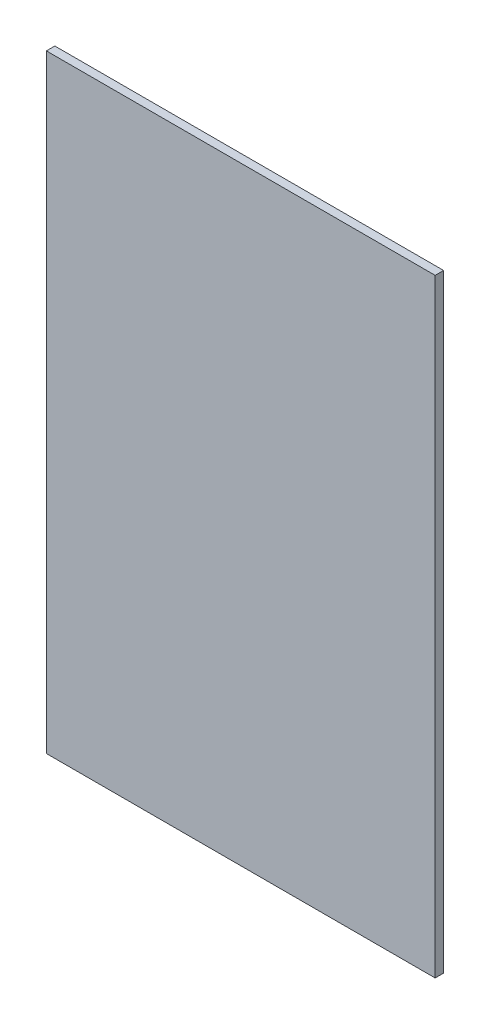
ISO-10303-21;
HEADER;
FILE_DESCRIPTION(('STEP AP214'),'2;1');
FILE_NAME('part.step','',(''),(''),'','','');
FILE_SCHEMA(('AUTOMOTIVE_DESIGN { 1 0 10303 214 1 1 1 1 }'));
ENDSEC;
DATA;
#1=APPLICATION_CONTEXT('core data for automotive mechanical design processes');
#2=APPLICATION_PROTOCOL_DEFINITION('international standard','automotive_design',2000,#1);
#3=PRODUCT_CONTEXT('',#1,'mechanical');
#4=PRODUCT('Part','Part','',(#3));
#5=PRODUCT_RELATED_PRODUCT_CATEGORY('part','',(#4));
#6=PRODUCT_DEFINITION_FORMATION('','',#4);
#7=PRODUCT_DEFINITION_CONTEXT('part definition',#1,'design');
#8=PRODUCT_DEFINITION('design','',#6,#7);
#9=PRODUCT_DEFINITION_SHAPE('','',#8);
#10=(LENGTH_UNIT() NAMED_UNIT(*) SI_UNIT(.MILLI.,.METRE.));
#11=(NAMED_UNIT(*) PLANE_ANGLE_UNIT() SI_UNIT($,.RADIAN.));
#12=(NAMED_UNIT(*) SI_UNIT($,.STERADIAN.) SOLID_ANGLE_UNIT());
#13=UNCERTAINTY_MEASURE_WITH_UNIT(LENGTH_MEASURE(1.E-05),#10,'distance_accuracy_value','');
#14=(GEOMETRIC_REPRESENTATION_CONTEXT(3) GLOBAL_UNCERTAINTY_ASSIGNED_CONTEXT((#13)) GLOBAL_UNIT_ASSIGNED_CONTEXT((#10,
#11,#12)) REPRESENTATION_CONTEXT('',''));
#15=CARTESIAN_POINT('',(0.,0.,0.));
#16=DIRECTION('',(0.,0.,1.));
#17=DIRECTION('',(1.,0.,0.));
#18=AXIS2_PLACEMENT_3D('',#15,#16,#17);
#19=CARTESIAN_POINT('',(292.1,-457.2,12.7));
#20=DIRECTION('',(-1.,0.,0.));
#21=DIRECTION('',(0.,0.,1.));
#22=AXIS2_PLACEMENT_3D('',#19,#20,#21);
#23=PLANE('',#22);
#24=DIRECTION('',(0.,1.,0.));
#25=VECTOR('',#24,1.);
#26=CARTESIAN_POINT('',(292.1,-457.2,0.));
#27=LINE('',#26,#25);
#28=CARTESIAN_POINT('',(292.1,-457.2,0.));
#29=VERTEX_POINT('',#28);
#30=CARTESIAN_POINT('',(292.1,457.2,0.));
#31=VERTEX_POINT('',#30);
#32=EDGE_CURVE('E96',#29,#31,#27,.T.);
#33=ORIENTED_EDGE('',*,*,#32,.T.);
#34=DIRECTION('',(0.,0.,-1.));
#35=VECTOR('',#34,1.);
#36=CARTESIAN_POINT('',(292.1,457.2,12.7));
#37=LINE('',#36,#35);
#38=CARTESIAN_POINT('',(292.1,457.2,12.7));
#39=VERTEX_POINT('',#38);
#40=EDGE_CURVE('E11',#39,#31,#37,.T.);
#41=ORIENTED_EDGE('',*,*,#40,.F.);
#42=DIRECTION('',(0.,1.,0.));
#43=VECTOR('',#42,1.);
#44=CARTESIAN_POINT('',(292.1,-457.2,12.7));
#45=LINE('',#44,#43);
#46=CARTESIAN_POINT('',(292.1,-457.2,12.7));
#47=VERTEX_POINT('',#46);
#48=EDGE_CURVE('E84',#47,#39,#45,.T.);
#49=ORIENTED_EDGE('',*,*,#48,.F.);
#50=DIRECTION('',(0.,0.,-1.));
#51=VECTOR('',#50,1.);
#52=CARTESIAN_POINT('',(292.1,-457.2,12.7));
#53=LINE('',#52,#51);
#54=EDGE_CURVE('E92',#47,#29,#53,.T.);
#55=ORIENTED_EDGE('',*,*,#54,.T.);
#56=EDGE_LOOP('',(#33,#41,#49,#55));
#57=FACE_BOUND('',#56,.T.);
#58=ADVANCED_FACE('F33',(#57),#23,.F.);
#59=CARTESIAN_POINT('',(-292.1,457.2,12.7));
#60=DIRECTION('',(0.,-1.,0.));
#61=DIRECTION('',(0.,0.,-1.));
#62=AXIS2_PLACEMENT_3D('',#59,#60,#61);
#63=PLANE('',#62);
#64=DIRECTION('',(-1.,0.,0.));
#65=VECTOR('',#64,1.);
#66=CARTESIAN_POINT('',(-292.1,457.2,0.));
#67=LINE('',#66,#65);
#68=CARTESIAN_POINT('',(-292.1,457.2,0.));
#69=VERTEX_POINT('',#68);
#70=EDGE_CURVE('E88',#31,#69,#67,.T.);
#71=ORIENTED_EDGE('',*,*,#70,.T.);
#72=DIRECTION('',(0.,0.,-1.));
#73=VECTOR('',#72,1.);
#74=CARTESIAN_POINT('',(-292.1,457.2,12.7));
#75=LINE('',#74,#73);
#76=CARTESIAN_POINT('',(-292.1,457.2,12.7));
#77=VERTEX_POINT('',#76);
#78=EDGE_CURVE('E41',#77,#69,#75,.T.);
#79=ORIENTED_EDGE('',*,*,#78,.F.);
#80=DIRECTION('',(-1.,0.,0.));
#81=VECTOR('',#80,1.);
#82=CARTESIAN_POINT('',(-292.1,457.2,12.7));
#83=LINE('',#82,#81);
#84=EDGE_CURVE('E79',#39,#77,#83,.T.);
#85=ORIENTED_EDGE('',*,*,#84,.F.);
#86=ORIENTED_EDGE('',*,*,#40,.T.);
#87=EDGE_LOOP('',(#71,#79,#85,#86));
#88=FACE_BOUND('',#87,.T.);
#89=ADVANCED_FACE('F87',(#88),#63,.F.);
#90=CARTESIAN_POINT('',(-292.1,-457.2,12.7));
#91=DIRECTION('',(1.,0.,0.));
#92=DIRECTION('',(0.,0.,-1.));
#93=AXIS2_PLACEMENT_3D('',#90,#91,#92);
#94=PLANE('',#93);
#95=DIRECTION('',(0.,-1.,0.));
#96=VECTOR('',#95,1.);
#97=CARTESIAN_POINT('',(-292.1,-457.2,0.));
#98=LINE('',#97,#96);
#99=CARTESIAN_POINT('',(-292.1,-457.2,0.));
#100=VERTEX_POINT('',#99);
#101=EDGE_CURVE('E66',#69,#100,#98,.T.);
#102=ORIENTED_EDGE('',*,*,#101,.T.);
#103=DIRECTION('',(0.,0.,-1.));
#104=VECTOR('',#103,1.);
#105=CARTESIAN_POINT('',(-292.1,-457.2,12.7));
#106=LINE('',#105,#104);
#107=CARTESIAN_POINT('',(-292.1,-457.2,12.7));
#108=VERTEX_POINT('',#107);
#109=EDGE_CURVE('E89',#108,#100,#106,.T.);
#110=ORIENTED_EDGE('',*,*,#109,.F.);
#111=DIRECTION('',(0.,-1.,0.));
#112=VECTOR('',#111,1.);
#113=CARTESIAN_POINT('',(-292.1,-457.2,12.7));
#114=LINE('',#113,#112);
#115=EDGE_CURVE('E82',#77,#108,#114,.T.);
#116=ORIENTED_EDGE('',*,*,#115,.F.);
#117=ORIENTED_EDGE('',*,*,#78,.T.);
#118=EDGE_LOOP('',(#102,#110,#116,#117));
#119=FACE_BOUND('',#118,.T.);
#120=ADVANCED_FACE('F90',(#119),#94,.F.);
#121=CARTESIAN_POINT('',(-292.1,-457.2,12.7));
#122=DIRECTION('',(0.,1.,0.));
#123=DIRECTION('',(0.,0.,1.));
#124=AXIS2_PLACEMENT_3D('',#121,#122,#123);
#125=PLANE('',#124);
#126=DIRECTION('',(1.,0.,0.));
#127=VECTOR('',#126,1.);
#128=CARTESIAN_POINT('',(-292.1,-457.2,0.));
#129=LINE('',#128,#127);
#130=EDGE_CURVE('E72',#100,#29,#129,.T.);
#131=ORIENTED_EDGE('',*,*,#130,.T.);
#132=ORIENTED_EDGE('',*,*,#54,.F.);
#133=DIRECTION('',(1.,0.,0.));
#134=VECTOR('',#133,1.);
#135=CARTESIAN_POINT('',(-292.1,-457.2,12.7));
#136=LINE('',#135,#134);
#137=EDGE_CURVE('E49',#108,#47,#136,.T.);
#138=ORIENTED_EDGE('',*,*,#137,.F.);
#139=ORIENTED_EDGE('',*,*,#109,.T.);
#140=EDGE_LOOP('',(#131,#132,#138,#139));
#141=FACE_BOUND('',#140,.T.);
#142=ADVANCED_FACE('F103',(#141),#125,.F.);
#143=CARTESIAN_POINT('',(0.,0.,12.7));
#144=DIRECTION('',(0.,0.,-1.));
#145=DIRECTION('',(-1.,0.,0.));
#146=AXIS2_PLACEMENT_3D('',#143,#144,#145);
#147=PLANE('',#146);
#148=ORIENTED_EDGE('',*,*,#48,.T.);
#149=ORIENTED_EDGE('',*,*,#84,.T.);
#150=ORIENTED_EDGE('',*,*,#115,.T.);
#151=ORIENTED_EDGE('',*,*,#137,.T.);
#152=EDGE_LOOP('',(#148,#149,#150,#151));
#153=FACE_BOUND('',#152,.T.);
#154=ADVANCED_FACE('F80',(#153),#147,.F.);
#155=CARTESIAN_POINT('',(0.,0.,0.));
#156=DIRECTION('',(0.,0.,-1.));
#157=DIRECTION('',(-1.,0.,0.));
#158=AXIS2_PLACEMENT_3D('',#155,#156,#157);
#159=PLANE('',#158);
#160=ORIENTED_EDGE('',*,*,#32,.F.);
#161=ORIENTED_EDGE('',*,*,#130,.F.);
#162=ORIENTED_EDGE('',*,*,#101,.F.);
#163=ORIENTED_EDGE('',*,*,#70,.F.);
#164=EDGE_LOOP('',(#160,#161,#162,#163));
#165=FACE_BOUND('',#164,.T.);
#166=ADVANCED_FACE('F106',(#165),#159,.T.);
#167=CLOSED_SHELL('',(#58,#89,#120,#142,#154,#166));
#168=MANIFOLD_SOLID_BREP('B2',#167);
#169=ADVANCED_BREP_SHAPE_REPRESENTATION('',(#18,#168),#14);
#170=SHAPE_DEFINITION_REPRESENTATION(#9,#169);
ENDSEC;
END-ISO-10303-21;
